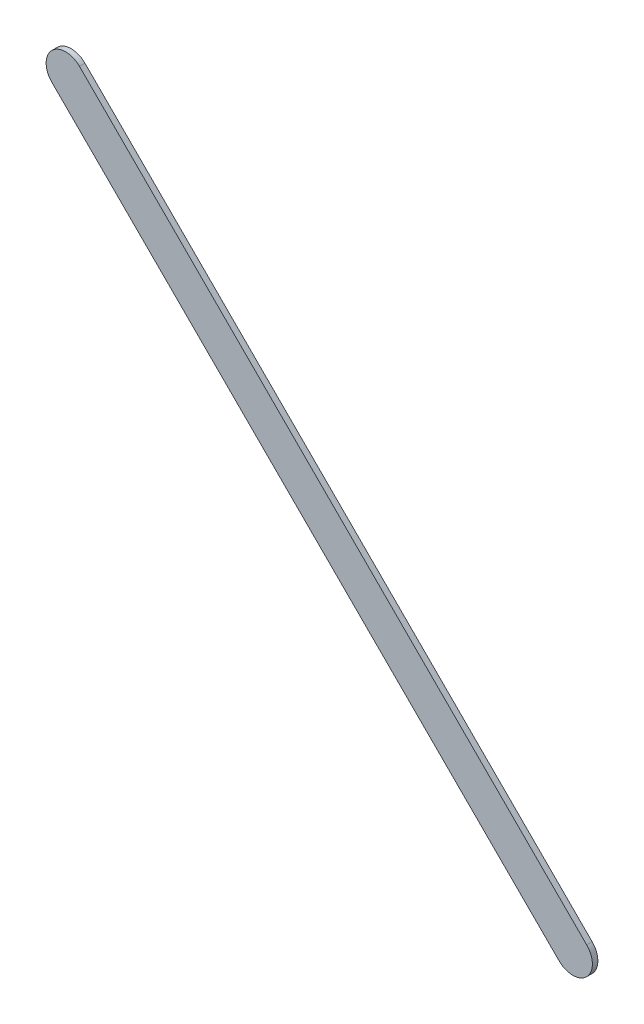
ISO-10303-21;
HEADER;
FILE_DESCRIPTION(('STEP AP214'),'2;1');
FILE_NAME('part.step','',(''),(''),'','','');
FILE_SCHEMA(('AUTOMOTIVE_DESIGN { 1 0 10303 214 1 1 1 1 }'));
ENDSEC;
DATA;
#1=APPLICATION_CONTEXT('core data for automotive mechanical design processes');
#2=APPLICATION_PROTOCOL_DEFINITION('international standard','automotive_design',2000,#1);
#3=PRODUCT_CONTEXT('',#1,'mechanical');
#4=PRODUCT('Part','Part','',(#3));
#5=PRODUCT_RELATED_PRODUCT_CATEGORY('part','',(#4));
#6=PRODUCT_DEFINITION_FORMATION('','',#4);
#7=PRODUCT_DEFINITION_CONTEXT('part definition',#1,'design');
#8=PRODUCT_DEFINITION('design','',#6,#7);
#9=PRODUCT_DEFINITION_SHAPE('','',#8);
#10=(LENGTH_UNIT() NAMED_UNIT(*) SI_UNIT(.MILLI.,.METRE.));
#11=(NAMED_UNIT(*) PLANE_ANGLE_UNIT() SI_UNIT($,.RADIAN.));
#12=(NAMED_UNIT(*) SI_UNIT($,.STERADIAN.) SOLID_ANGLE_UNIT());
#13=UNCERTAINTY_MEASURE_WITH_UNIT(LENGTH_MEASURE(1.E-05),#10,'distance_accuracy_value','');
#14=(GEOMETRIC_REPRESENTATION_CONTEXT(3) GLOBAL_UNCERTAINTY_ASSIGNED_CONTEXT((#13)) GLOBAL_UNIT_ASSIGNED_CONTEXT((#10,
#11,#12)) REPRESENTATION_CONTEXT('',''));
#15=CARTESIAN_POINT('',(0.,0.,0.));
#16=DIRECTION('',(0.,0.,1.));
#17=DIRECTION('',(1.,0.,0.));
#18=AXIS2_PLACEMENT_3D('',#15,#16,#17);
#19=CARTESIAN_POINT('',(99.3271699,104.89717146,0.));
#20=DIRECTION('',(0.707106781186548,0.707106781186548,0.));
#21=DIRECTION('',(0.707106781186548,-0.707106781186548,0.));
#22=AXIS2_PLACEMENT_3D('',#19,#20,#21);
#23=PLANE('',#22);
#24=DIRECTION('',(0.707106781186548,-0.707106781186548,0.));
#25=VECTOR('',#24,1.);
#26=CARTESIAN_POINT('',(99.3271699,104.89717146,0.03556));
#27=LINE('',#26,#25);
#28=CARTESIAN_POINT('',(99.3271699,104.89717146,0.03556));
#29=VERTEX_POINT('',#28);
#30=CARTESIAN_POINT('',(102.62717092,101.59717044,0.03556));
#31=VERTEX_POINT('',#30);
#32=EDGE_CURVE('E11',#29,#31,#27,.T.);
#33=ORIENTED_EDGE('',*,*,#32,.F.);
#34=DIRECTION('',(0.,0.,1.));
#35=VECTOR('',#34,1.);
#36=CARTESIAN_POINT('',(99.3271699,104.89717146,0.));
#37=LINE('',#36,#35);
#38=CARTESIAN_POINT('',(99.3271699,104.89717146,0.));
#39=VERTEX_POINT('',#38);
#40=EDGE_CURVE('E24',#39,#29,#37,.T.);
#41=ORIENTED_EDGE('',*,*,#40,.F.);
#42=DIRECTION('',(0.707106781186548,-0.707106781186548,0.));
#43=VECTOR('',#42,1.);
#44=CARTESIAN_POINT('',(99.3271699,104.89717146,0.));
#45=LINE('',#44,#43);
#46=CARTESIAN_POINT('',(102.62717092,101.59717044,0.));
#47=VERTEX_POINT('',#46);
#48=EDGE_CURVE('E75',#39,#47,#45,.T.);
#49=ORIENTED_EDGE('',*,*,#48,.T.);
#50=DIRECTION('',(0.,0.,1.));
#51=VECTOR('',#50,1.);
#52=CARTESIAN_POINT('',(102.62717092,101.59717044,0.));
#53=LINE('',#52,#51);
#54=EDGE_CURVE('E37',#47,#31,#53,.T.);
#55=ORIENTED_EDGE('',*,*,#54,.T.);
#56=EDGE_LOOP('',(#33,#41,#49,#55));
#57=FACE_BOUND('',#56,.T.);
#58=ADVANCED_FACE('F17',(#57),#23,.F.);
#59=CARTESIAN_POINT('',(102.71697262,101.68697341,0.));
#60=DIRECTION('',(0.,0.,-1.));
#61=DIRECTION('',(-0.707101781156225,-0.707111781181515,0.));
#62=AXIS2_PLACEMENT_3D('',#59,#60,#61);
#63=CYLINDRICAL_SURFACE('',#62,0.126999680092946);
#64=CARTESIAN_POINT('',(102.71697262,101.68697341,0.03556));
#65=DIRECTION('',(0.,0.,1.));
#66=DIRECTION('',(-0.707101781156225,-0.707111781181515,0.));
#67=AXIS2_PLACEMENT_3D('',#64,#65,#66);
#68=CIRCLE('',#67,0.126999680092946);
#69=CARTESIAN_POINT('',(102.80677432,101.77677638,0.03556));
#70=VERTEX_POINT('',#69);
#71=EDGE_CURVE('E83',#31,#70,#68,.T.);
#72=ORIENTED_EDGE('',*,*,#71,.F.);
#73=ORIENTED_EDGE('',*,*,#54,.F.);
#74=CARTESIAN_POINT('',(102.71697262,101.68697341,0.));
#75=DIRECTION('',(0.,0.,1.));
#76=DIRECTION('',(-0.707101781156225,-0.707111781181515,0.));
#77=AXIS2_PLACEMENT_3D('',#74,#75,#76);
#78=CIRCLE('',#77,0.126999680092946);
#79=CARTESIAN_POINT('',(102.80677432,101.77677638,0.));
#80=VERTEX_POINT('',#79);
#81=EDGE_CURVE('E81',#47,#80,#78,.T.);
#82=ORIENTED_EDGE('',*,*,#81,.T.);
#83=DIRECTION('',(0.,0.,1.));
#84=VECTOR('',#83,1.);
#85=CARTESIAN_POINT('',(102.80677432,101.77677638,0.));
#86=LINE('',#85,#84);
#87=EDGE_CURVE('E67',#80,#70,#86,.T.);
#88=ORIENTED_EDGE('',*,*,#87,.T.);
#89=EDGE_LOOP('',(#72,#73,#82,#88));
#90=FACE_BOUND('',#89,.T.);
#91=ADVANCED_FACE('F89',(#90),#63,.T.);
#92=CARTESIAN_POINT('',(102.80677432,101.77677638,0.));
#93=DIRECTION('',(-0.707106781186548,-0.707106781186548,0.));
#94=DIRECTION('',(-0.707106781186548,0.707106781186548,0.));
#95=AXIS2_PLACEMENT_3D('',#92,#93,#94);
#96=PLANE('',#95);
#97=DIRECTION('',(-0.707106781186548,0.707106781186548,0.));
#98=VECTOR('',#97,1.);
#99=CARTESIAN_POINT('',(102.80677432,101.77677638,0.03556));
#100=LINE('',#99,#98);
#101=CARTESIAN_POINT('',(99.50677584,105.07677486,0.03556));
#102=VERTEX_POINT('',#101);
#103=EDGE_CURVE('E71',#70,#102,#100,.T.);
#104=ORIENTED_EDGE('',*,*,#103,.F.);
#105=ORIENTED_EDGE('',*,*,#87,.F.);
#106=DIRECTION('',(-0.707106781186548,0.707106781186548,0.));
#107=VECTOR('',#106,1.);
#108=CARTESIAN_POINT('',(102.80677432,101.77677638,0.));
#109=LINE('',#108,#107);
#110=CARTESIAN_POINT('',(99.50677584,105.07677486,0.));
#111=VERTEX_POINT('',#110);
#112=EDGE_CURVE('E63',#80,#111,#109,.T.);
#113=ORIENTED_EDGE('',*,*,#112,.T.);
#114=DIRECTION('',(0.,0.,1.));
#115=VECTOR('',#114,1.);
#116=CARTESIAN_POINT('',(99.50677584,105.07677486,0.));
#117=LINE('',#116,#115);
#118=EDGE_CURVE('E53',#111,#102,#117,.T.);
#119=ORIENTED_EDGE('',*,*,#118,.T.);
#120=EDGE_LOOP('',(#104,#105,#113,#119));
#121=FACE_BOUND('',#120,.T.);
#122=ADVANCED_FACE('F66',(#121),#96,.F.);
#123=CARTESIAN_POINT('',(99.41697287,104.98697316,0.));
#124=DIRECTION('',(0.,0.,-1.));
#125=DIRECTION('',(0.707111781181459,0.707101781156281,0.));
#126=AXIS2_PLACEMENT_3D('',#123,#124,#125);
#127=CYLINDRICAL_SURFACE('',#126,0.126999680092946);
#128=CARTESIAN_POINT('',(99.41697287,104.98697316,0.03556));
#129=DIRECTION('',(0.,0.,1.));
#130=DIRECTION('',(0.707111781181459,0.707101781156281,0.));
#131=AXIS2_PLACEMENT_3D('',#128,#129,#130);
#132=CIRCLE('',#131,0.126999680092946);
#133=EDGE_CURVE('E59',#102,#29,#132,.T.);
#134=ORIENTED_EDGE('',*,*,#133,.F.);
#135=ORIENTED_EDGE('',*,*,#118,.F.);
#136=CARTESIAN_POINT('',(99.41697287,104.98697316,0.));
#137=DIRECTION('',(0.,0.,1.));
#138=DIRECTION('',(0.707111781181459,0.707101781156281,0.));
#139=AXIS2_PLACEMENT_3D('',#136,#137,#138);
#140=CIRCLE('',#139,0.126999680092946);
#141=EDGE_CURVE('E57',#111,#39,#140,.T.);
#142=ORIENTED_EDGE('',*,*,#141,.T.);
#143=ORIENTED_EDGE('',*,*,#40,.T.);
#144=EDGE_LOOP('',(#134,#135,#142,#143));
#145=FACE_BOUND('',#144,.T.);
#146=ADVANCED_FACE('F55',(#145),#127,.T.);
#147=CARTESIAN_POINT('',(99.3271699,104.89717146,0.));
#148=DIRECTION('',(0.,0.,-1.));
#149=DIRECTION('',(-1.,0.,0.));
#150=AXIS2_PLACEMENT_3D('',#147,#148,#149);
#151=PLANE('',#150);
#152=ORIENTED_EDGE('',*,*,#141,.F.);
#153=ORIENTED_EDGE('',*,*,#112,.F.);
#154=ORIENTED_EDGE('',*,*,#81,.F.);
#155=ORIENTED_EDGE('',*,*,#48,.F.);
#156=EDGE_LOOP('',(#152,#153,#154,#155));
#157=FACE_BOUND('',#156,.T.);
#158=ADVANCED_FACE('F74',(#157),#151,.T.);
#159=CARTESIAN_POINT('',(99.3271699,104.89717146,0.03556));
#160=DIRECTION('',(0.,0.,-1.));
#161=DIRECTION('',(-1.,0.,0.));
#162=AXIS2_PLACEMENT_3D('',#159,#160,#161);
#163=PLANE('',#162);
#164=ORIENTED_EDGE('',*,*,#32,.T.);
#165=ORIENTED_EDGE('',*,*,#71,.T.);
#166=ORIENTED_EDGE('',*,*,#103,.T.);
#167=ORIENTED_EDGE('',*,*,#133,.T.);
#168=EDGE_LOOP('',(#164,#165,#166,#167));
#169=FACE_BOUND('',#168,.T.);
#170=ADVANCED_FACE('F91',(#169),#163,.F.);
#171=CLOSED_SHELL('',(#58,#91,#122,#146,#158,#170));
#172=MANIFOLD_SOLID_BREP('B1',#171);
#173=ADVANCED_BREP_SHAPE_REPRESENTATION('',(#18,#172),#14);
#174=SHAPE_DEFINITION_REPRESENTATION(#9,#173);
ENDSEC;
END-ISO-10303-21;
